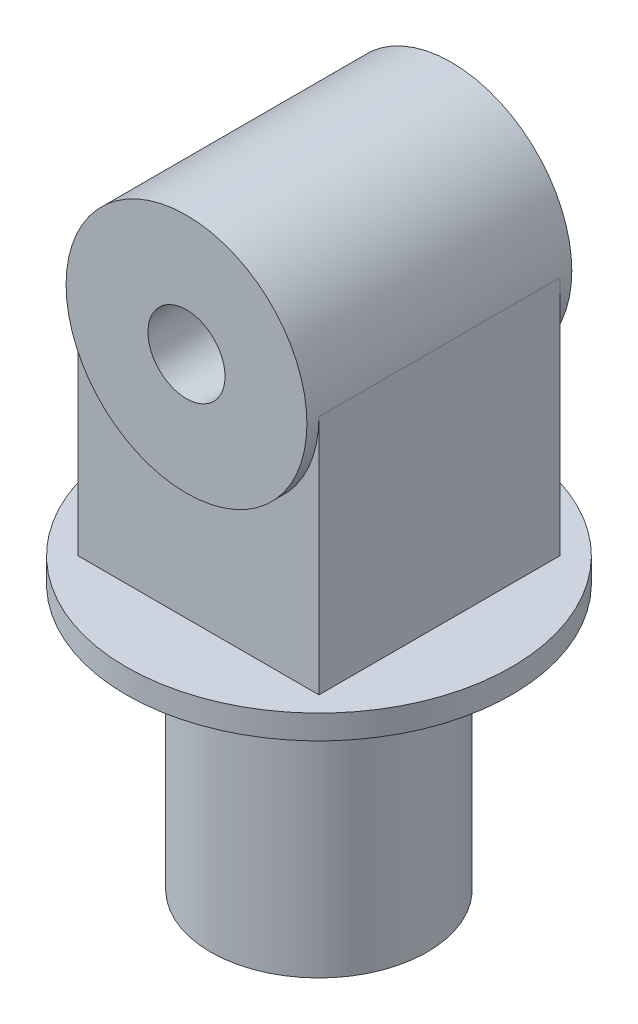
ISO-10303-21;
HEADER;
FILE_DESCRIPTION(('STEP AP214'),'2;1');
FILE_NAME('part.step','',(''),(''),'','','');
FILE_SCHEMA(('AUTOMOTIVE_DESIGN { 1 0 10303 214 1 1 1 1 }'));
ENDSEC;
DATA;
#1=APPLICATION_CONTEXT('core data for automotive mechanical design processes');
#2=APPLICATION_PROTOCOL_DEFINITION('international standard','automotive_design',2000,#1);
#3=PRODUCT_CONTEXT('',#1,'mechanical');
#4=PRODUCT('Part','Part','',(#3));
#5=PRODUCT_RELATED_PRODUCT_CATEGORY('part','',(#4));
#6=PRODUCT_DEFINITION_FORMATION('','',#4);
#7=PRODUCT_DEFINITION_CONTEXT('part definition',#1,'design');
#8=PRODUCT_DEFINITION('design','',#6,#7);
#9=PRODUCT_DEFINITION_SHAPE('','',#8);
#10=(LENGTH_UNIT() NAMED_UNIT(*) SI_UNIT(.MILLI.,.METRE.));
#11=(NAMED_UNIT(*) PLANE_ANGLE_UNIT() SI_UNIT($,.RADIAN.));
#12=(NAMED_UNIT(*) SI_UNIT($,.STERADIAN.) SOLID_ANGLE_UNIT());
#13=UNCERTAINTY_MEASURE_WITH_UNIT(LENGTH_MEASURE(1.E-05),#10,'distance_accuracy_value','');
#14=(GEOMETRIC_REPRESENTATION_CONTEXT(3) GLOBAL_UNCERTAINTY_ASSIGNED_CONTEXT((#13)) GLOBAL_UNIT_ASSIGNED_CONTEXT((#10,
#11,#12)) REPRESENTATION_CONTEXT('',''));
#15=CARTESIAN_POINT('',(0.,0.,0.));
#16=DIRECTION('',(0.,0.,1.));
#17=DIRECTION('',(1.,0.,0.));
#18=AXIS2_PLACEMENT_3D('',#15,#16,#17);
#19=CARTESIAN_POINT('',(0.,60.,0.));
#20=DIRECTION('',(0.,-1.,0.));
#21=DIRECTION('',(0.,0.,-1.));
#22=AXIS2_PLACEMENT_3D('',#19,#20,#21);
#23=CYLINDRICAL_SURFACE('',#22,22.5);
#24=CARTESIAN_POINT('',(0.,0.,0.));
#25=DIRECTION('',(0.,1.,0.));
#26=DIRECTION('',(0.,0.,1.));
#27=AXIS2_PLACEMENT_3D('',#24,#25,#26);
#28=CIRCLE('',#27,22.5);
#29=CARTESIAN_POINT('',(0.,0.,22.5));
#30=VERTEX_POINT('',#29);
#31=EDGE_CURVE('E42',#30,#30,#28,.T.);
#32=ORIENTED_EDGE('',*,*,#31,.T.);
#33=EDGE_LOOP('',(#32));
#34=FACE_BOUND('',#33,.T.);
#35=CARTESIAN_POINT('',(0.,55.,0.));
#36=DIRECTION('',(0.,1.,0.));
#37=DIRECTION('',(0.,0.,1.));
#38=AXIS2_PLACEMENT_3D('',#35,#36,#37);
#39=CIRCLE('',#38,22.5);
#40=CARTESIAN_POINT('',(0.,55.,22.5));
#41=VERTEX_POINT('',#40);
#42=EDGE_CURVE('E11',#41,#41,#39,.T.);
#43=ORIENTED_EDGE('',*,*,#42,.F.);
#44=EDGE_LOOP('',(#43));
#45=FACE_BOUND('',#44,.T.);
#46=ADVANCED_FACE('F34',(#34,#45),#23,.T.);
#47=CARTESIAN_POINT('',(0.,0.,0.));
#48=DIRECTION('',(0.,1.,0.));
#49=DIRECTION('',(0.,0.,1.));
#50=AXIS2_PLACEMENT_3D('',#47,#48,#49);
#51=PLANE('',#50);
#52=ORIENTED_EDGE('',*,*,#31,.F.);
#53=EDGE_LOOP('',(#52));
#54=FACE_BOUND('',#53,.T.);
#55=ADVANCED_FACE('F122',(#54),#51,.F.);
#56=CARTESIAN_POINT('',(0.,55.,0.));
#57=DIRECTION('',(0.,1.,0.));
#58=DIRECTION('',(0.,0.,1.));
#59=AXIS2_PLACEMENT_3D('',#56,#57,#58);
#60=CYLINDRICAL_SURFACE('',#59,40.);
#61=CARTESIAN_POINT('',(0.,55.,0.));
#62=DIRECTION('',(0.,1.,0.));
#63=DIRECTION('',(0.,0.,1.));
#64=AXIS2_PLACEMENT_3D('',#61,#62,#63);
#65=CIRCLE('',#64,40.);
#66=CARTESIAN_POINT('',(0.,55.,40.));
#67=VERTEX_POINT('',#66);
#68=EDGE_CURVE('E112',#67,#67,#65,.T.);
#69=ORIENTED_EDGE('',*,*,#68,.T.);
#70=EDGE_LOOP('',(#69));
#71=FACE_BOUND('',#70,.T.);
#72=CARTESIAN_POINT('',(0.,60.,0.));
#73=DIRECTION('',(0.,1.,0.));
#74=DIRECTION('',(0.,0.,1.));
#75=AXIS2_PLACEMENT_3D('',#72,#73,#74);
#76=CIRCLE('',#75,40.);
#77=CARTESIAN_POINT('',(0.,60.,40.));
#78=VERTEX_POINT('',#77);
#79=EDGE_CURVE('E82',#78,#78,#76,.T.);
#80=ORIENTED_EDGE('',*,*,#79,.F.);
#81=EDGE_LOOP('',(#80));
#82=FACE_BOUND('',#81,.T.);
#83=ADVANCED_FACE('F124',(#71,#82),#60,.T.);
#84=CARTESIAN_POINT('',(0.,55.,0.));
#85=DIRECTION('',(0.,1.,0.));
#86=DIRECTION('',(0.,0.,1.));
#87=AXIS2_PLACEMENT_3D('',#84,#85,#86);
#88=PLANE('',#87);
#89=ORIENTED_EDGE('',*,*,#42,.T.);
#90=EDGE_LOOP('',(#89));
#91=FACE_BOUND('',#90,.T.);
#92=ORIENTED_EDGE('',*,*,#68,.F.);
#93=EDGE_LOOP('',(#92));
#94=FACE_BOUND('',#93,.T.);
#95=ADVANCED_FACE('F129',(#91,#94),#88,.F.);
#96=CARTESIAN_POINT('',(0.,60.,0.));
#97=DIRECTION('',(0.,1.,0.));
#98=DIRECTION('',(0.,0.,1.));
#99=AXIS2_PLACEMENT_3D('',#96,#97,#98);
#100=PLANE('',#99);
#101=DIRECTION('',(0.,0.,-1.));
#102=VECTOR('',#101,1.);
#103=CARTESIAN_POINT('',(25.,60.,25.));
#104=LINE('',#103,#102);
#105=CARTESIAN_POINT('',(25.,60.,25.));
#106=VERTEX_POINT('',#105);
#107=CARTESIAN_POINT('',(25.,60.,-25.));
#108=VERTEX_POINT('',#107);
#109=EDGE_CURVE('E49',#106,#108,#104,.T.);
#110=ORIENTED_EDGE('',*,*,#109,.F.);
#111=DIRECTION('',(1.,0.,0.));
#112=VECTOR('',#111,1.);
#113=CARTESIAN_POINT('',(-25.,60.,25.));
#114=LINE('',#113,#112);
#115=CARTESIAN_POINT('',(-25.,60.,25.));
#116=VERTEX_POINT('',#115);
#117=EDGE_CURVE('E53',#116,#106,#114,.T.);
#118=ORIENTED_EDGE('',*,*,#117,.F.);
#119=DIRECTION('',(0.,0.,1.));
#120=VECTOR('',#119,1.);
#121=CARTESIAN_POINT('',(-25.,60.,25.));
#122=LINE('',#121,#120);
#123=CARTESIAN_POINT('',(-25.,60.,-25.));
#124=VERTEX_POINT('',#123);
#125=EDGE_CURVE('E99',#124,#116,#122,.T.);
#126=ORIENTED_EDGE('',*,*,#125,.F.);
#127=DIRECTION('',(-1.,0.,0.));
#128=VECTOR('',#127,1.);
#129=CARTESIAN_POINT('',(-25.,60.,-25.));
#130=LINE('',#129,#128);
#131=EDGE_CURVE('E104',#108,#124,#130,.T.);
#132=ORIENTED_EDGE('',*,*,#131,.F.);
#133=EDGE_LOOP('',(#110,#118,#126,#132));
#134=FACE_BOUND('',#133,.T.);
#135=ORIENTED_EDGE('',*,*,#79,.T.);
#136=EDGE_LOOP('',(#135));
#137=FACE_BOUND('',#136,.T.);
#138=ADVANCED_FACE('F133',(#134,#137),#100,.T.);
#139=CARTESIAN_POINT('',(25.,110.,25.));
#140=DIRECTION('',(-1.,0.,0.));
#141=DIRECTION('',(0.,0.,1.));
#142=AXIS2_PLACEMENT_3D('',#139,#140,#141);
#143=PLANE('',#142);
#144=ORIENTED_EDGE('',*,*,#109,.T.);
#145=DIRECTION('',(0.,-1.,0.));
#146=VECTOR('',#145,1.);
#147=CARTESIAN_POINT('',(25.,110.,-25.));
#148=LINE('',#147,#146);
#149=CARTESIAN_POINT('',(25.,110.,-25.));
#150=VERTEX_POINT('',#149);
#151=EDGE_CURVE('E73',#150,#108,#148,.T.);
#152=ORIENTED_EDGE('',*,*,#151,.F.);
#153=DIRECTION('',(0.,0.,-1.));
#154=VECTOR('',#153,1.);
#155=CARTESIAN_POINT('',(25.,110.,25.));
#156=LINE('',#155,#154);
#157=CARTESIAN_POINT('',(25.,110.,25.));
#158=VERTEX_POINT('',#157);
#159=EDGE_CURVE('E78',#158,#150,#156,.T.);
#160=ORIENTED_EDGE('',*,*,#159,.F.);
#161=DIRECTION('',(0.,-1.,0.));
#162=VECTOR('',#161,1.);
#163=CARTESIAN_POINT('',(25.,110.,25.));
#164=LINE('',#163,#162);
#165=EDGE_CURVE('E97',#158,#106,#164,.T.);
#166=ORIENTED_EDGE('',*,*,#165,.T.);
#167=EDGE_LOOP('',(#144,#152,#160,#166));
#168=FACE_BOUND('',#167,.T.);
#169=ADVANCED_FACE('F75',(#168),#143,.F.);
#170=CARTESIAN_POINT('',(-25.,110.,-25.));
#171=DIRECTION('',(0.,0.,1.));
#172=DIRECTION('',(1.,0.,0.));
#173=AXIS2_PLACEMENT_3D('',#170,#171,#172);
#174=PLANE('',#173);
#175=CARTESIAN_POINT('',(0.,110.,-25.));
#176=DIRECTION('',(0.,0.,1.));
#177=DIRECTION('',(1.,0.,0.));
#178=AXIS2_PLACEMENT_3D('',#175,#176,#177);
#179=CIRCLE('',#178,25.);
#180=CARTESIAN_POINT('',(-25.,110.,-25.));
#181=VERTEX_POINT('',#180);
#182=EDGE_CURVE('E86',#150,#181,#179,.F.);
#183=ORIENTED_EDGE('',*,*,#182,.F.);
#184=ORIENTED_EDGE('',*,*,#151,.T.);
#185=ORIENTED_EDGE('',*,*,#131,.T.);
#186=DIRECTION('',(0.,-1.,0.));
#187=VECTOR('',#186,1.);
#188=CARTESIAN_POINT('',(-25.,110.,-25.));
#189=LINE('',#188,#187);
#190=EDGE_CURVE('E83',#181,#124,#189,.T.);
#191=ORIENTED_EDGE('',*,*,#190,.F.);
#192=EDGE_LOOP('',(#183,#184,#185,#191));
#193=FACE_BOUND('',#192,.T.);
#194=ADVANCED_FACE('F87',(#193),#174,.F.);
#195=CARTESIAN_POINT('',(-25.,110.,25.));
#196=DIRECTION('',(1.,0.,0.));
#197=DIRECTION('',(0.,0.,-1.));
#198=AXIS2_PLACEMENT_3D('',#195,#196,#197);
#199=PLANE('',#198);
#200=ORIENTED_EDGE('',*,*,#125,.T.);
#201=DIRECTION('',(0.,-1.,0.));
#202=VECTOR('',#201,1.);
#203=CARTESIAN_POINT('',(-25.,110.,25.));
#204=LINE('',#203,#202);
#205=CARTESIAN_POINT('',(-25.,110.,25.));
#206=VERTEX_POINT('',#205);
#207=EDGE_CURVE('E108',#206,#116,#204,.T.);
#208=ORIENTED_EDGE('',*,*,#207,.F.);
#209=DIRECTION('',(0.,0.,1.));
#210=VECTOR('',#209,1.);
#211=CARTESIAN_POINT('',(-25.,110.,25.));
#212=LINE('',#211,#210);
#213=EDGE_CURVE('E95',#181,#206,#212,.T.);
#214=ORIENTED_EDGE('',*,*,#213,.F.);
#215=ORIENTED_EDGE('',*,*,#190,.T.);
#216=EDGE_LOOP('',(#200,#208,#214,#215));
#217=FACE_BOUND('',#216,.T.);
#218=ADVANCED_FACE('F143',(#217),#199,.F.);
#219=CARTESIAN_POINT('',(-25.,110.,25.));
#220=DIRECTION('',(0.,0.,-1.));
#221=DIRECTION('',(-1.,0.,0.));
#222=AXIS2_PLACEMENT_3D('',#219,#220,#221);
#223=PLANE('',#222);
#224=CARTESIAN_POINT('',(0.,110.,25.));
#225=DIRECTION('',(0.,0.,-1.));
#226=DIRECTION('',(-1.,0.,0.));
#227=AXIS2_PLACEMENT_3D('',#224,#225,#226);
#228=CIRCLE('',#227,25.);
#229=EDGE_CURVE('E92',#206,#158,#228,.F.);
#230=ORIENTED_EDGE('',*,*,#229,.F.);
#231=ORIENTED_EDGE('',*,*,#207,.T.);
#232=ORIENTED_EDGE('',*,*,#117,.T.);
#233=ORIENTED_EDGE('',*,*,#165,.F.);
#234=EDGE_LOOP('',(#230,#231,#232,#233));
#235=FACE_BOUND('',#234,.T.);
#236=ADVANCED_FACE('F146',(#235),#223,.F.);
#237=CARTESIAN_POINT('',(0.,110.,27.5));
#238=DIRECTION('',(0.,0.,-1.));
#239=DIRECTION('',(-1.,0.,0.));
#240=AXIS2_PLACEMENT_3D('',#237,#238,#239);
#241=CYLINDRICAL_SURFACE('',#240,25.);
#242=CARTESIAN_POINT('',(0.,110.,27.5));
#243=DIRECTION('',(0.,0.,1.));
#244=DIRECTION('',(1.,0.,0.));
#245=AXIS2_PLACEMENT_3D('',#242,#243,#244);
#246=CIRCLE('',#245,25.);
#247=CARTESIAN_POINT('',(25.,110.,27.5));
#248=VERTEX_POINT('',#247);
#249=EDGE_CURVE('E175',#248,#248,#246,.T.);
#250=ORIENTED_EDGE('',*,*,#249,.F.);
#251=EDGE_LOOP('',(#250));
#252=FACE_BOUND('',#251,.T.);
#253=CARTESIAN_POINT('',(0.,110.,-27.5));
#254=DIRECTION('',(0.,0.,1.));
#255=DIRECTION('',(1.,0.,0.));
#256=AXIS2_PLACEMENT_3D('',#253,#254,#255);
#257=CIRCLE('',#256,25.);
#258=CARTESIAN_POINT('',(25.,110.,-27.5));
#259=VERTEX_POINT('',#258);
#260=EDGE_CURVE('E173',#259,#259,#257,.T.);
#261=ORIENTED_EDGE('',*,*,#260,.T.);
#262=EDGE_LOOP('',(#261));
#263=FACE_BOUND('',#262,.T.);
#264=ORIENTED_EDGE('',*,*,#159,.T.);
#265=ORIENTED_EDGE('',*,*,#182,.T.);
#266=ORIENTED_EDGE('',*,*,#213,.T.);
#267=ORIENTED_EDGE('',*,*,#229,.T.);
#268=EDGE_LOOP('',(#264,#265,#266,#267));
#269=FACE_BOUND('',#268,.T.);
#270=ADVANCED_FACE('F94',(#252,#263,#269),#241,.T.);
#271=CARTESIAN_POINT('',(0.,110.,27.5));
#272=DIRECTION('',(0.,0.,1.));
#273=DIRECTION('',(1.,0.,0.));
#274=AXIS2_PLACEMENT_3D('',#271,#272,#273);
#275=PLANE('',#274);
#276=CARTESIAN_POINT('',(0.,110.,27.5));
#277=DIRECTION('',(0.,0.,1.));
#278=DIRECTION('',(1.,0.,0.));
#279=AXIS2_PLACEMENT_3D('',#276,#277,#278);
#280=CIRCLE('',#279,8.);
#281=CARTESIAN_POINT('',(8.,110.,27.5));
#282=VERTEX_POINT('',#281);
#283=EDGE_CURVE('E170',#282,#282,#280,.T.);
#284=ORIENTED_EDGE('',*,*,#283,.F.);
#285=EDGE_LOOP('',(#284));
#286=FACE_BOUND('',#285,.T.);
#287=ORIENTED_EDGE('',*,*,#249,.T.);
#288=EDGE_LOOP('',(#287));
#289=FACE_BOUND('',#288,.T.);
#290=ADVANCED_FACE('F153',(#286,#289),#275,.T.);
#291=CARTESIAN_POINT('',(0.,110.,-27.5));
#292=DIRECTION('',(0.,0.,1.));
#293=DIRECTION('',(1.,0.,0.));
#294=AXIS2_PLACEMENT_3D('',#291,#292,#293);
#295=PLANE('',#294);
#296=CARTESIAN_POINT('',(0.,110.,-27.5));
#297=DIRECTION('',(0.,0.,1.));
#298=DIRECTION('',(1.,0.,0.));
#299=AXIS2_PLACEMENT_3D('',#296,#297,#298);
#300=CIRCLE('',#299,8.);
#301=CARTESIAN_POINT('',(8.,110.,-27.5));
#302=VERTEX_POINT('',#301);
#303=EDGE_CURVE('E37',#302,#302,#300,.T.);
#304=ORIENTED_EDGE('',*,*,#303,.T.);
#305=EDGE_LOOP('',(#304));
#306=FACE_BOUND('',#305,.T.);
#307=ORIENTED_EDGE('',*,*,#260,.F.);
#308=EDGE_LOOP('',(#307));
#309=FACE_BOUND('',#308,.T.);
#310=ADVANCED_FACE('F155',(#306,#309),#295,.F.);
#311=CARTESIAN_POINT('',(0.,110.,-40.));
#312=DIRECTION('',(0.,0.,1.));
#313=DIRECTION('',(1.,0.,0.));
#314=AXIS2_PLACEMENT_3D('',#311,#312,#313);
#315=CYLINDRICAL_SURFACE('',#314,8.);
#316=ORIENTED_EDGE('',*,*,#283,.T.);
#317=EDGE_LOOP('',(#316));
#318=FACE_BOUND('',#317,.T.);
#319=ORIENTED_EDGE('',*,*,#303,.F.);
#320=EDGE_LOOP('',(#319));
#321=FACE_BOUND('',#320,.T.);
#322=ADVANCED_FACE('F158',(#318,#321),#315,.F.);
#323=CLOSED_SHELL('',(#46,#55,#83,#95,#138,#169,#194,#218,#236,#270,#290,#310,#322));
#324=MANIFOLD_SOLID_BREP('B2',#323);
#325=ADVANCED_BREP_SHAPE_REPRESENTATION('',(#18,#324),#14);
#326=SHAPE_DEFINITION_REPRESENTATION(#9,#325);
ENDSEC;
END-ISO-10303-21;
